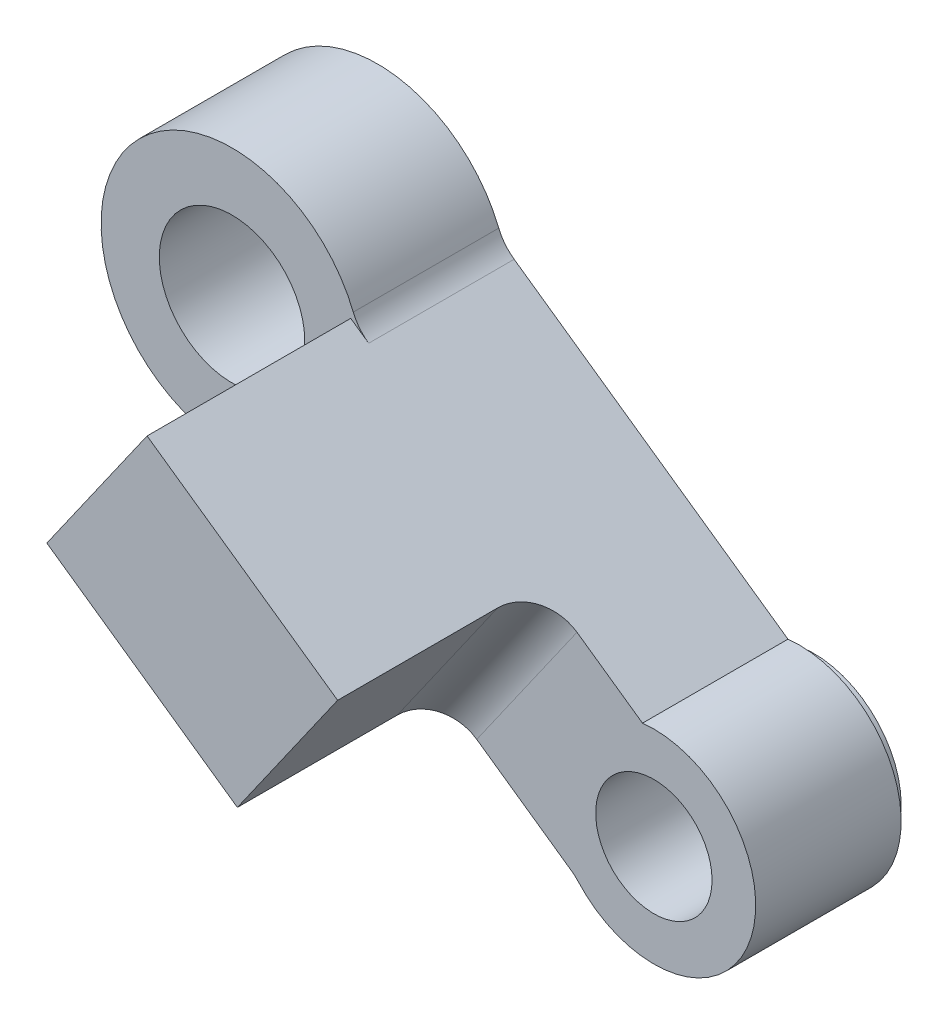
ISO-10303-21;
HEADER;
FILE_DESCRIPTION(('STEP AP214'),'2;1');
FILE_NAME('part.step','',(''),(''),'','','');
FILE_SCHEMA(('AUTOMOTIVE_DESIGN { 1 0 10303 214 1 1 1 1 }'));
ENDSEC;
DATA;
#1=APPLICATION_CONTEXT('core data for automotive mechanical design processes');
#2=APPLICATION_PROTOCOL_DEFINITION('international standard','automotive_design',2000,#1);
#3=PRODUCT_CONTEXT('',#1,'mechanical');
#4=PRODUCT('Part','Part','',(#3));
#5=PRODUCT_RELATED_PRODUCT_CATEGORY('part','',(#4));
#6=PRODUCT_DEFINITION_FORMATION('','',#4);
#7=PRODUCT_DEFINITION_CONTEXT('part definition',#1,'design');
#8=PRODUCT_DEFINITION('design','',#6,#7);
#9=PRODUCT_DEFINITION_SHAPE('','',#8);
#10=(LENGTH_UNIT() NAMED_UNIT(*) SI_UNIT(.MILLI.,.METRE.));
#11=(NAMED_UNIT(*) PLANE_ANGLE_UNIT() SI_UNIT($,.RADIAN.));
#12=(NAMED_UNIT(*) SI_UNIT($,.STERADIAN.) SOLID_ANGLE_UNIT());
#13=UNCERTAINTY_MEASURE_WITH_UNIT(LENGTH_MEASURE(1.E-05),#10,'distance_accuracy_value','');
#14=(GEOMETRIC_REPRESENTATION_CONTEXT(3) GLOBAL_UNCERTAINTY_ASSIGNED_CONTEXT((#13)) GLOBAL_UNIT_ASSIGNED_CONTEXT((#10,
#11,#12)) REPRESENTATION_CONTEXT('',''));
#15=CARTESIAN_POINT('',(0.,0.,0.));
#16=DIRECTION('',(0.,0.,1.));
#17=DIRECTION('',(1.,0.,0.));
#18=AXIS2_PLACEMENT_3D('',#15,#16,#17);
#19=CARTESIAN_POINT('',(14.5,-9.05,-5.));
#20=DIRECTION('',(0.,0.,-1.));
#21=DIRECTION('',(1.,0.,0.));
#22=AXIS2_PLACEMENT_3D('',#19,#20,#21);
#23=PLANE('',#22);
#24=CARTESIAN_POINT('',(0.,0.,-5.));
#25=DIRECTION('',(0.,0.,1.));
#26=DIRECTION('',(1.,0.,0.));
#27=AXIS2_PLACEMENT_3D('',#24,#25,#26);
#28=CIRCLE('',#27,2.5);
#29=CARTESIAN_POINT('',(2.5,0.,-5.));
#30=VERTEX_POINT('',#29);
#31=EDGE_CURVE('E167',#30,#30,#28,.T.);
#32=ORIENTED_EDGE('',*,*,#31,.T.);
#33=EDGE_LOOP('',(#32));
#34=FACE_BOUND('',#33,.T.);
#35=DIRECTION('',(-0.818662724250934,0.574274624132078,0.));
#36=VECTOR('',#35,1.);
#37=CARTESIAN_POINT('',(4.30670005617379,1.30473546213503,-5.));
#38=LINE('',#37,#36);
#39=CARTESIAN_POINT('',(14.1096606419003,-5.57183450860682,-5.));
#40=VERTEX_POINT('',#39);
#41=CARTESIAN_POINT('',(4.69715552562135,1.03083919042865,-5.));
#42=VERTEX_POINT('',#41);
#43=EDGE_CURVE('E175',#40,#42,#38,.T.);
#44=ORIENTED_EDGE('',*,*,#43,.F.);
#45=CARTESIAN_POINT('',(14.5,-9.05,-5.));
#46=DIRECTION('',(0.,0.,1.));
#47=DIRECTION('',(1.,0.,0.));
#48=AXIS2_PLACEMENT_3D('',#45,#46,#47);
#49=CIRCLE('',#48,3.5);
#50=CARTESIAN_POINT('',(11.9072437974673,-11.40108810431,-5.));
#51=VERTEX_POINT('',#50);
#52=EDGE_CURVE('E173',#51,#40,#49,.T.);
#53=ORIENTED_EDGE('',*,*,#52,.F.);
#54=CARTESIAN_POINT('',(10.7960625678104,-12.4086972918714,-5.));
#55=DIRECTION('',(0.,0.,1.));
#56=DIRECTION('',(1.,0.,0.));
#57=AXIS2_PLACEMENT_3D('',#54,#55,#56);
#58=CIRCLE('',#57,1.5);
#59=CARTESIAN_POINT('',(11.6574745040085,-11.180703205495,-5.));
#60=VERTEX_POINT('',#59);
#61=EDGE_CURVE('E11',#60,#51,#58,.F.);
#62=ORIENTED_EDGE('',*,*,#61,.F.);
#63=DIRECTION('',(0.818662724250933,-0.574274624132079,0.));
#64=VECTOR('',#63,1.);
#65=CARTESIAN_POINT('',(1.67358332842939,-4.17721424430244,-5.));
#66=LINE('',#65,#64);
#67=CARTESIAN_POINT('',(2.27925096573256,-4.60207730995562,-5.));
#68=VERTEX_POINT('',#67);
#69=EDGE_CURVE('E182',#68,#60,#66,.T.);
#70=ORIENTED_EDGE('',*,*,#69,.F.);
#71=CARTESIAN_POINT('',(1.41783902953444,-5.83007139633202,-5.));
#72=DIRECTION('',(0.,0.,1.));
#73=DIRECTION('',(1.,0.,0.));
#74=AXIS2_PLACEMENT_3D('',#71,#72,#73);
#75=CIRCLE('',#74,1.5);
#76=CARTESIAN_POINT('',(1.06337927215083,-4.37255354724902,-5.));
#77=VERTEX_POINT('',#76);
#78=EDGE_CURVE('E227',#77,#68,#75,.F.);
#79=ORIENTED_EDGE('',*,*,#78,.F.);
#80=CARTESIAN_POINT('',(0.,0.,-5.));
#81=DIRECTION('',(0.,0.,1.));
#82=DIRECTION('',(-1.,0.,0.));
#83=AXIS2_PLACEMENT_3D('',#80,#81,#82);
#84=CIRCLE('',#83,4.5);
#85=CARTESIAN_POINT('',(4.1689255963646,1.69412495760379,-5.));
#86=VERTEX_POINT('',#85);
#87=EDGE_CURVE('E179',#86,#77,#84,.T.);
#88=ORIENTED_EDGE('',*,*,#87,.F.);
#89=CARTESIAN_POINT('',(5.55856746181947,2.25883327680505,-5.));
#90=DIRECTION('',(0.,0.,1.));
#91=DIRECTION('',(1.,0.,0.));
#92=AXIS2_PLACEMENT_3D('',#89,#90,#91);
#93=CIRCLE('',#92,1.5);
#94=EDGE_CURVE('E209',#42,#86,#93,.F.);
#95=ORIENTED_EDGE('',*,*,#94,.F.);
#96=EDGE_LOOP('',(#44,#53,#62,#70,#79,#88,#95));
#97=FACE_BOUND('',#96,.T.);
#98=CARTESIAN_POINT('',(14.5,-9.05,-5.));
#99=DIRECTION('',(0.,0.,1.));
#100=DIRECTION('',(1.,0.,0.));
#101=AXIS2_PLACEMENT_3D('',#98,#99,#100);
#102=CIRCLE('',#101,3.00000000000009);
#103=CARTESIAN_POINT('',(17.5000000000001,-9.05,-5.));
#104=VERTEX_POINT('',#103);
#105=EDGE_CURVE('E257',#104,#104,#102,.T.);
#106=ORIENTED_EDGE('',*,*,#105,.T.);
#107=EDGE_LOOP('',(#106));
#108=FACE_BOUND('',#107,.T.);
#109=ADVANCED_FACE('F35',(#34,#97,#108),#23,.T.);
#110=CARTESIAN_POINT('',(14.5,-9.05,0.));
#111=DIRECTION('',(0.,0.,-1.));
#112=DIRECTION('',(1.,0.,0.));
#113=AXIS2_PLACEMENT_3D('',#110,#111,#112);
#114=PLANE('',#113);
#115=CARTESIAN_POINT('',(14.5,-9.05,0.));
#116=DIRECTION('',(0.,0.,1.));
#117=DIRECTION('',(1.,0.,0.));
#118=AXIS2_PLACEMENT_3D('',#115,#116,#117);
#119=CIRCLE('',#118,2.00000000000009);
#120=CARTESIAN_POINT('',(16.5000000000001,-9.05,0.));
#121=VERTEX_POINT('',#120);
#122=EDGE_CURVE('E163',#121,#121,#119,.T.);
#123=ORIENTED_EDGE('',*,*,#122,.F.);
#124=EDGE_LOOP('',(#123));
#125=FACE_BOUND('',#124,.T.);
#126=DIRECTION('',(0.818662724250933,-0.574274624132079,0.));
#127=VECTOR('',#126,1.);
#128=CARTESIAN_POINT('',(1.67358332842939,-4.17721424430244,0.));
#129=LINE('',#128,#127);
#130=CARTESIAN_POINT('',(8.41202205939429,-8.90408680711841,0.));
#131=VERTEX_POINT('',#130);
#132=CARTESIAN_POINT('',(11.6574745040085,-11.180703205495,0.));
#133=VERTEX_POINT('',#132);
#134=EDGE_CURVE('E176',#131,#133,#129,.T.);
#135=ORIENTED_EDGE('',*,*,#134,.T.);
#136=CARTESIAN_POINT('',(10.7960625678104,-12.4086972918714,0.));
#137=DIRECTION('',(0.,0.,1.));
#138=DIRECTION('',(1.,0.,0.));
#139=AXIS2_PLACEMENT_3D('',#136,#137,#138);
#140=CIRCLE('',#139,1.5);
#141=CARTESIAN_POINT('',(11.9072437974673,-11.40108810431,0.));
#142=VERTEX_POINT('',#141);
#143=EDGE_CURVE('E43',#142,#133,#140,.T.);
#144=ORIENTED_EDGE('',*,*,#143,.F.);
#145=CARTESIAN_POINT('',(14.5,-9.05,0.));
#146=DIRECTION('',(0.,0.,1.));
#147=DIRECTION('',(1.,0.,0.));
#148=AXIS2_PLACEMENT_3D('',#145,#146,#147);
#149=CIRCLE('',#148,3.5);
#150=CARTESIAN_POINT('',(14.1096606419003,-5.57183450860682,0.));
#151=VERTEX_POINT('',#150);
#152=EDGE_CURVE('E170',#142,#151,#149,.T.);
#153=ORIENTED_EDGE('',*,*,#152,.T.);
#154=DIRECTION('',(-0.818662724250934,0.574274624132078,0.));
#155=VECTOR('',#154,1.);
#156=CARTESIAN_POINT('',(4.30670005617379,1.30473546213503,0.));
#157=LINE('',#156,#155);
#158=CARTESIAN_POINT('',(11.8576698041868,-3.9921104616128,0.));
#159=VERTEX_POINT('',#158);
#160=EDGE_CURVE('E188',#151,#159,#157,.T.);
#161=ORIENTED_EDGE('',*,*,#160,.T.);
#162=DIRECTION('',(0.574274624132079,0.818662724250933,0.));
#163=VECTOR('',#162,1.);
#164=CARTESIAN_POINT('',(10.3511852621264,-6.13969401731833,0.));
#165=LINE('',#164,#163);
#166=EDGE_CURVE('E201',#131,#159,#165,.T.);
#167=ORIENTED_EDGE('',*,*,#166,.F.);
#168=EDGE_LOOP('',(#135,#144,#153,#161,#167));
#169=FACE_BOUND('',#168,.T.);
#170=ADVANCED_FACE('F233',(#125,#169),#114,.F.);
#171=CARTESIAN_POINT('',(0.,0.,0.));
#172=DIRECTION('',(0.,0.,1.));
#173=DIRECTION('',(-1.,0.,0.));
#174=AXIS2_PLACEMENT_3D('',#171,#172,#173);
#175=CIRCLE('',#174,4.5);
#176=CARTESIAN_POINT('',(4.1689255963646,1.69412495760379,0.));
#177=VERTEX_POINT('',#176);
#178=CARTESIAN_POINT('',(1.06337927215083,-4.37255354724902,0.));
#179=VERTEX_POINT('',#178);
#180=EDGE_CURVE('E191',#177,#179,#175,.T.);
#181=ORIENTED_EDGE('',*,*,#180,.T.);
#182=CARTESIAN_POINT('',(1.41783902953444,-5.83007139633202,0.));
#183=DIRECTION('',(0.,0.,1.));
#184=DIRECTION('',(1.,0.,0.));
#185=AXIS2_PLACEMENT_3D('',#182,#183,#184);
#186=CIRCLE('',#185,1.5);
#187=CARTESIAN_POINT('',(2.27925096573256,-4.60207730995562,0.));
#188=VERTEX_POINT('',#187);
#189=EDGE_CURVE('E224',#188,#179,#186,.T.);
#190=ORIENTED_EDGE('',*,*,#189,.F.);
#191=DIRECTION('',(0.818662724250933,-0.574274624132079,0.));
#192=VECTOR('',#191,1.);
#193=CARTESIAN_POINT('',(12.5608367972679,-11.8143927898001,0.));
#194=LINE('',#193,#192);
#195=CARTESIAN_POINT('',(0.634726179010426,-3.44847787786366,0.));
#196=VERTEX_POINT('',#195);
#197=EDGE_CURVE('E159',#196,#188,#194,.T.);
#198=ORIENTED_EDGE('',*,*,#197,.F.);
#199=DIRECTION('',(-0.574274624132079,-0.818662724250933,0.));
#200=VECTOR('',#199,1.);
#201=CARTESIAN_POINT('',(2.57388938174258,-0.684085088063578,0.));
#202=LINE('',#201,#200);
#203=CARTESIAN_POINT('',(2.04665681062733,-1.4356865603302,0.));
#204=VERTEX_POINT('',#203);
#205=EDGE_CURVE('E149',#204,#196,#202,.T.);
#206=ORIENTED_EDGE('',*,*,#205,.F.);
#207=CARTESIAN_POINT('',(0.,0.,0.));
#208=DIRECTION('',(0.,0.,1.));
#209=DIRECTION('',(1.,0.,0.));
#210=AXIS2_PLACEMENT_3D('',#207,#208,#209);
#211=CIRCLE('',#210,2.5);
#212=EDGE_CURVE('E166',#204,#204,#211,.T.);
#213=ORIENTED_EDGE('',*,*,#212,.F.);
#214=CARTESIAN_POINT('',(4.0803739238029,1.46349846764194,0.));
#215=VERTEX_POINT('',#214);
#216=EDGE_CURVE('E151',#215,#204,#202,.T.);
#217=ORIENTED_EDGE('',*,*,#216,.F.);
#218=DIRECTION('',(-0.818662724250934,0.574274624132078,0.));
#219=VECTOR('',#218,1.);
#220=CARTESIAN_POINT('',(16.0064845420603,-6.90241644429447,0.));
#221=LINE('',#220,#219);
#222=CARTESIAN_POINT('',(4.69715552562135,1.03083919042865,0.));
#223=VERTEX_POINT('',#222);
#224=EDGE_CURVE('E147',#223,#215,#221,.T.);
#225=ORIENTED_EDGE('',*,*,#224,.F.);
#226=CARTESIAN_POINT('',(5.55856746181947,2.25883327680505,0.));
#227=DIRECTION('',(0.,0.,1.));
#228=DIRECTION('',(1.,0.,0.));
#229=AXIS2_PLACEMENT_3D('',#226,#227,#228);
#230=CIRCLE('',#229,1.5);
#231=EDGE_CURVE('E206',#177,#223,#230,.T.);
#232=ORIENTED_EDGE('',*,*,#231,.F.);
#233=EDGE_LOOP('',(#181,#190,#198,#206,#213,#217,#225,#232));
#234=FACE_BOUND('',#233,.T.);
#235=ADVANCED_FACE('F286',(#234),#114,.F.);
#236=CARTESIAN_POINT('',(14.5,-9.05,-5.));
#237=DIRECTION('',(0.,0.,1.));
#238=DIRECTION('',(-1.,0.,0.));
#239=AXIS2_PLACEMENT_3D('',#236,#237,#238);
#240=CYLINDRICAL_SURFACE('',#239,3.5);
#241=ORIENTED_EDGE('',*,*,#52,.T.);
#242=DIRECTION('',(0.,0.,1.));
#243=VECTOR('',#242,1.);
#244=CARTESIAN_POINT('',(14.1096606419003,-5.57183450860682,-5.));
#245=LINE('',#244,#243);
#246=EDGE_CURVE('E185',#40,#151,#245,.T.);
#247=ORIENTED_EDGE('',*,*,#246,.T.);
#248=ORIENTED_EDGE('',*,*,#152,.F.);
#249=DIRECTION('',(0.,0.,1.));
#250=VECTOR('',#249,1.);
#251=CARTESIAN_POINT('',(11.9072437974673,-11.40108810431,-5.));
#252=LINE('',#251,#250);
#253=EDGE_CURVE('E50',#51,#142,#252,.T.);
#254=ORIENTED_EDGE('',*,*,#253,.F.);
#255=EDGE_LOOP('',(#241,#247,#248,#254));
#256=FACE_BOUND('',#255,.T.);
#257=ADVANCED_FACE('F246',(#256),#240,.T.);
#258=CARTESIAN_POINT('',(4.30670005617379,1.30473546213503,-5.));
#259=DIRECTION('',(-0.574274624132078,-0.818662724250934,0.));
#260=DIRECTION('',(0.818662724250934,-0.574274624132078,0.));
#261=AXIS2_PLACEMENT_3D('',#258,#259,#260);
#262=PLANE('',#261);
#263=ORIENTED_EDGE('',*,*,#224,.T.);
#264=DIRECTION('',(0.,0.,1.));
#265=VECTOR('',#264,1.);
#266=CARTESIAN_POINT('',(4.0803739238029,1.46349846764194,-18.7937068196315));
#267=LINE('',#266,#265);
#268=CARTESIAN_POINT('',(4.0803739238029,1.46349846764194,7.));
#269=VERTEX_POINT('',#268);
#270=EDGE_CURVE('E128',#215,#269,#267,.T.);
#271=ORIENTED_EDGE('',*,*,#270,.T.);
#272=DIRECTION('',(0.818662724250934,-0.574274624132078,0.));
#273=VECTOR('',#272,1.);
#274=CARTESIAN_POINT('',(4.0803739238029,1.46349846764194,7.));
#275=LINE('',#274,#273);
#276=CARTESIAN_POINT('',(10.6296757178104,-3.13069852541468,7.));
#277=VERTEX_POINT('',#276);
#278=EDGE_CURVE('E135',#269,#277,#275,.T.);
#279=ORIENTED_EDGE('',*,*,#278,.T.);
#280=DIRECTION('',(0.,0.,1.));
#281=VECTOR('',#280,1.);
#282=CARTESIAN_POINT('',(10.6296757178104,-3.13069852541468,-18.7937068196315));
#283=LINE('',#282,#281);
#284=CARTESIAN_POINT('',(10.6296757178104,-3.13069852541468,1.5));
#285=VERTEX_POINT('',#284);
#286=EDGE_CURVE('E156',#285,#277,#283,.T.);
#287=ORIENTED_EDGE('',*,*,#286,.F.);
#288=CARTESIAN_POINT('',(11.8576698041868,-3.9921104616128,1.5));
#289=DIRECTION('',(0.574274624132078,0.818662724250934,0.));
#290=DIRECTION('',(0.818662724250934,-0.574274624132078,0.));
#291=AXIS2_PLACEMENT_3D('',#288,#289,#290);
#292=CIRCLE('',#291,1.5);
#293=EDGE_CURVE('E212',#159,#285,#292,.T.);
#294=ORIENTED_EDGE('',*,*,#293,.F.);
#295=ORIENTED_EDGE('',*,*,#160,.F.);
#296=ORIENTED_EDGE('',*,*,#246,.F.);
#297=ORIENTED_EDGE('',*,*,#43,.T.);
#298=DIRECTION('',(0.,0.,-1.));
#299=VECTOR('',#298,1.);
#300=CARTESIAN_POINT('',(4.69715552562135,1.03083919042865,-5.));
#301=LINE('',#300,#299);
#302=EDGE_CURVE('E199',#223,#42,#301,.T.);
#303=ORIENTED_EDGE('',*,*,#302,.F.);
#304=EDGE_LOOP('',(#263,#271,#279,#287,#294,#295,#296,#297,#303));
#305=FACE_BOUND('',#304,.T.);
#306=ADVANCED_FACE('F145',(#305),#262,.F.);
#307=CARTESIAN_POINT('',(0.,0.,-5.));
#308=DIRECTION('',(0.,0.,1.));
#309=DIRECTION('',(-1.,0.,0.));
#310=AXIS2_PLACEMENT_3D('',#307,#308,#309);
#311=CYLINDRICAL_SURFACE('',#310,4.5);
#312=ORIENTED_EDGE('',*,*,#180,.F.);
#313=DIRECTION('',(0.,0.,1.));
#314=VECTOR('',#313,1.);
#315=CARTESIAN_POINT('',(4.1689255963646,1.69412495760379,-5.));
#316=LINE('',#315,#314);
#317=EDGE_CURVE('E197',#86,#177,#316,.T.);
#318=ORIENTED_EDGE('',*,*,#317,.F.);
#319=ORIENTED_EDGE('',*,*,#87,.T.);
#320=DIRECTION('',(0.,0.,1.));
#321=VECTOR('',#320,1.);
#322=CARTESIAN_POINT('',(1.06337927215083,-4.37255354724902,-5.));
#323=LINE('',#322,#321);
#324=EDGE_CURVE('E221',#179,#77,#323,.F.);
#325=ORIENTED_EDGE('',*,*,#324,.F.);
#326=EDGE_LOOP('',(#312,#318,#319,#325));
#327=FACE_BOUND('',#326,.T.);
#328=ADVANCED_FACE('F294',(#327),#311,.T.);
#329=CARTESIAN_POINT('',(1.67358332842939,-4.17721424430244,-5.));
#330=DIRECTION('',(0.574274624132079,0.818662724250933,0.));
#331=DIRECTION('',(-0.818662724250933,0.574274624132079,0.));
#332=AXIS2_PLACEMENT_3D('',#329,#330,#331);
#333=PLANE('',#332);
#334=ORIENTED_EDGE('',*,*,#69,.T.);
#335=DIRECTION('',(0.,0.,-1.));
#336=VECTOR('',#335,1.);
#337=CARTESIAN_POINT('',(11.6574745040085,-11.180703205495,-5.));
#338=LINE('',#337,#336);
#339=EDGE_CURVE('E217',#133,#60,#338,.T.);
#340=ORIENTED_EDGE('',*,*,#339,.F.);
#341=ORIENTED_EDGE('',*,*,#134,.F.);
#342=CARTESIAN_POINT('',(8.41202205939429,-8.9040868071184,1.5));
#343=DIRECTION('',(-0.574274624132079,-0.818662724250933,0.));
#344=DIRECTION('',(-0.818662724250933,0.574274624132079,0.));
#345=AXIS2_PLACEMENT_3D('',#342,#343,#344);
#346=CIRCLE('',#345,1.5);
#347=CARTESIAN_POINT('',(7.18402797301789,-8.04267487092029,1.5));
#348=VERTEX_POINT('',#347);
#349=EDGE_CURVE('E215',#348,#131,#346,.T.);
#350=ORIENTED_EDGE('',*,*,#349,.F.);
#351=DIRECTION('',(0.,0.,1.));
#352=VECTOR('',#351,1.);
#353=CARTESIAN_POINT('',(7.18402797301789,-8.04267487092029,-18.7937068196315));
#354=LINE('',#353,#352);
#355=CARTESIAN_POINT('',(7.18402797301789,-8.04267487092029,7.));
#356=VERTEX_POINT('',#355);
#357=EDGE_CURVE('E153',#348,#356,#354,.T.);
#358=ORIENTED_EDGE('',*,*,#357,.T.);
#359=DIRECTION('',(-0.818662724250933,0.574274624132079,0.));
#360=VECTOR('',#359,1.);
#361=CARTESIAN_POINT('',(0.634726179010426,-3.44847787786366,7.));
#362=LINE('',#361,#360);
#363=CARTESIAN_POINT('',(0.634726179010426,-3.44847787786366,7.));
#364=VERTEX_POINT('',#363);
#365=EDGE_CURVE('E253',#356,#364,#362,.T.);
#366=ORIENTED_EDGE('',*,*,#365,.T.);
#367=DIRECTION('',(0.,0.,1.));
#368=VECTOR('',#367,1.);
#369=CARTESIAN_POINT('',(0.634726179010426,-3.44847787786366,-18.7937068196315));
#370=LINE('',#369,#368);
#371=EDGE_CURVE('E131',#196,#364,#370,.T.);
#372=ORIENTED_EDGE('',*,*,#371,.F.);
#373=ORIENTED_EDGE('',*,*,#197,.T.);
#374=DIRECTION('',(0.,0.,-1.));
#375=VECTOR('',#374,1.);
#376=CARTESIAN_POINT('',(2.27925096573256,-4.60207730995562,0.));
#377=LINE('',#376,#375);
#378=EDGE_CURVE('E219',#68,#188,#377,.F.);
#379=ORIENTED_EDGE('',*,*,#378,.F.);
#380=EDGE_LOOP('',(#334,#340,#341,#350,#358,#366,#372,#373,#379));
#381=FACE_BOUND('',#380,.T.);
#382=ADVANCED_FACE('F236',(#381),#333,.F.);
#383=CARTESIAN_POINT('',(0.,0.,-5.));
#384=DIRECTION('',(0.,0.,1.));
#385=DIRECTION('',(-1.,0.,0.));
#386=AXIS2_PLACEMENT_3D('',#383,#384,#385);
#387=CYLINDRICAL_SURFACE('',#386,2.5);
#388=ORIENTED_EDGE('',*,*,#212,.T.);
#389=EDGE_LOOP('',(#388));
#390=FACE_BOUND('',#389,.T.);
#391=ORIENTED_EDGE('',*,*,#31,.F.);
#392=EDGE_LOOP('',(#391));
#393=FACE_BOUND('',#392,.T.);
#394=ADVANCED_FACE('F270',(#390,#393),#387,.F.);
#395=CARTESIAN_POINT('',(14.5,-9.05,-5.));
#396=DIRECTION('',(0.,0.,1.));
#397=DIRECTION('',(-1.,0.,0.));
#398=AXIS2_PLACEMENT_3D('',#395,#396,#397);
#399=CYLINDRICAL_SURFACE('',#398,2.00000000000009);
#400=ORIENTED_EDGE('',*,*,#122,.T.);
#401=EDGE_LOOP('',(#400));
#402=FACE_BOUND('',#401,.T.);
#403=CARTESIAN_POINT('',(14.5,-9.05,-5.5));
#404=DIRECTION('',(0.,0.,1.));
#405=DIRECTION('',(1.,0.,0.));
#406=AXIS2_PLACEMENT_3D('',#403,#404,#405);
#407=CIRCLE('',#406,2.00000000000009);
#408=CARTESIAN_POINT('',(16.5000000000001,-9.05,-5.5));
#409=VERTEX_POINT('',#408);
#410=EDGE_CURVE('E260',#409,#409,#407,.T.);
#411=ORIENTED_EDGE('',*,*,#410,.F.);
#412=EDGE_LOOP('',(#411));
#413=FACE_BOUND('',#412,.T.);
#414=ADVANCED_FACE('F268',(#402,#413),#399,.F.);
#415=CARTESIAN_POINT('',(7.18402797301789,-8.04267487092029,-18.7937068196315));
#416=DIRECTION('',(0.818662724250933,-0.574274624132079,0.));
#417=DIRECTION('',(0.574274624132079,0.818662724250933,0.));
#418=AXIS2_PLACEMENT_3D('',#415,#416,#417);
#419=PLANE('',#418);
#420=ORIENTED_EDGE('',*,*,#286,.T.);
#421=DIRECTION('',(-0.574274624132079,-0.818662724250933,0.));
#422=VECTOR('',#421,1.);
#423=CARTESIAN_POINT('',(7.18402797301789,-8.04267487092029,7.));
#424=LINE('',#423,#422);
#425=EDGE_CURVE('E140',#277,#356,#424,.T.);
#426=ORIENTED_EDGE('',*,*,#425,.T.);
#427=ORIENTED_EDGE('',*,*,#357,.F.);
#428=DIRECTION('',(0.574274624132079,0.818662724250933,0.));
#429=VECTOR('',#428,1.);
#430=CARTESIAN_POINT('',(7.18402797301789,-8.04267487092029,1.5));
#431=LINE('',#430,#429);
#432=EDGE_CURVE('E204',#285,#348,#431,.F.);
#433=ORIENTED_EDGE('',*,*,#432,.F.);
#434=EDGE_LOOP('',(#420,#426,#427,#433));
#435=FACE_BOUND('',#434,.T.);
#436=ADVANCED_FACE('F252',(#435),#419,.T.);
#437=CARTESIAN_POINT('',(0.634726179010426,-3.44847787786366,-18.7937068196315));
#438=DIRECTION('',(-0.818662724250933,0.574274624132079,0.));
#439=DIRECTION('',(-0.574274624132079,-0.818662724250933,0.));
#440=AXIS2_PLACEMENT_3D('',#437,#438,#439);
#441=PLANE('',#440);
#442=ORIENTED_EDGE('',*,*,#216,.T.);
#443=ORIENTED_EDGE('',*,*,#205,.T.);
#444=ORIENTED_EDGE('',*,*,#371,.T.);
#445=DIRECTION('',(0.574274624132079,0.818662724250933,0.));
#446=VECTOR('',#445,1.);
#447=CARTESIAN_POINT('',(0.634726179010426,-3.44847787786366,7.));
#448=LINE('',#447,#446);
#449=EDGE_CURVE('E124',#364,#269,#448,.T.);
#450=ORIENTED_EDGE('',*,*,#449,.T.);
#451=ORIENTED_EDGE('',*,*,#270,.F.);
#452=EDGE_LOOP('',(#442,#443,#444,#450,#451));
#453=FACE_BOUND('',#452,.T.);
#454=ADVANCED_FACE('F126',(#453),#441,.T.);
#455=CARTESIAN_POINT('',(0.,0.,7.));
#456=DIRECTION('',(0.,0.,1.));
#457=DIRECTION('',(-1.,0.,0.));
#458=AXIS2_PLACEMENT_3D('',#455,#456,#457);
#459=PLANE('',#458);
#460=ORIENTED_EDGE('',*,*,#449,.F.);
#461=ORIENTED_EDGE('',*,*,#365,.F.);
#462=ORIENTED_EDGE('',*,*,#425,.F.);
#463=ORIENTED_EDGE('',*,*,#278,.F.);
#464=EDGE_LOOP('',(#460,#461,#462,#463));
#465=FACE_BOUND('',#464,.T.);
#466=ADVANCED_FACE('F139',(#465),#459,.T.);
#467=CARTESIAN_POINT('',(5.55856746181947,2.25883327680505,-5.));
#468=DIRECTION('',(0.,0.,1.));
#469=DIRECTION('',(-1.,0.,0.));
#470=AXIS2_PLACEMENT_3D('',#467,#468,#469);
#471=CYLINDRICAL_SURFACE('',#470,1.5);
#472=ORIENTED_EDGE('',*,*,#94,.T.);
#473=ORIENTED_EDGE('',*,*,#317,.T.);
#474=ORIENTED_EDGE('',*,*,#231,.T.);
#475=ORIENTED_EDGE('',*,*,#302,.T.);
#476=EDGE_LOOP('',(#472,#473,#474,#475));
#477=FACE_BOUND('',#476,.T.);
#478=ADVANCED_FACE('F302',(#477),#471,.F.);
#479=CARTESIAN_POINT('',(10.3511852621264,-6.13969401731833,1.5));
#480=DIRECTION('',(0.574274624132079,0.818662724250933,0.));
#481=DIRECTION('',(-0.818662724250933,0.574274624132079,0.));
#482=AXIS2_PLACEMENT_3D('',#479,#480,#481);
#483=CYLINDRICAL_SURFACE('',#482,1.5);
#484=ORIENTED_EDGE('',*,*,#349,.T.);
#485=ORIENTED_EDGE('',*,*,#166,.T.);
#486=ORIENTED_EDGE('',*,*,#293,.T.);
#487=ORIENTED_EDGE('',*,*,#432,.T.);
#488=EDGE_LOOP('',(#484,#485,#486,#487));
#489=FACE_BOUND('',#488,.T.);
#490=ADVANCED_FACE('F249',(#489),#483,.F.);
#491=CARTESIAN_POINT('',(1.41783902953444,-5.83007139633202,-5.));
#492=DIRECTION('',(0.,0.,1.));
#493=DIRECTION('',(-1.,0.,0.));
#494=AXIS2_PLACEMENT_3D('',#491,#492,#493);
#495=CYLINDRICAL_SURFACE('',#494,1.5);
#496=ORIENTED_EDGE('',*,*,#78,.T.);
#497=ORIENTED_EDGE('',*,*,#378,.T.);
#498=ORIENTED_EDGE('',*,*,#189,.T.);
#499=ORIENTED_EDGE('',*,*,#324,.T.);
#500=EDGE_LOOP('',(#496,#497,#498,#499));
#501=FACE_BOUND('',#500,.T.);
#502=ADVANCED_FACE('F307',(#501),#495,.F.);
#503=CARTESIAN_POINT('',(10.7960625678104,-12.4086972918714,-5.));
#504=DIRECTION('',(0.,0.,1.));
#505=DIRECTION('',(-1.,0.,0.));
#506=AXIS2_PLACEMENT_3D('',#503,#504,#505);
#507=CYLINDRICAL_SURFACE('',#506,1.5);
#508=ORIENTED_EDGE('',*,*,#61,.T.);
#509=ORIENTED_EDGE('',*,*,#253,.T.);
#510=ORIENTED_EDGE('',*,*,#143,.T.);
#511=ORIENTED_EDGE('',*,*,#339,.T.);
#512=EDGE_LOOP('',(#508,#509,#510,#511));
#513=FACE_BOUND('',#512,.T.);
#514=ADVANCED_FACE('F37',(#513),#507,.F.);
#515=CARTESIAN_POINT('',(14.5,-9.05,-5.5));
#516=DIRECTION('',(0.,0.,-1.));
#517=DIRECTION('',(1.,0.,0.));
#518=AXIS2_PLACEMENT_3D('',#515,#516,#517);
#519=PLANE('',#518);
#520=CARTESIAN_POINT('',(14.5,-9.05,-5.5));
#521=DIRECTION('',(0.,0.,1.));
#522=DIRECTION('',(1.,0.,0.));
#523=AXIS2_PLACEMENT_3D('',#520,#521,#522);
#524=CIRCLE('',#523,3.00000000000009);
#525=CARTESIAN_POINT('',(17.5000000000001,-9.05,-5.5));
#526=VERTEX_POINT('',#525);
#527=EDGE_CURVE('E136',#526,#526,#524,.T.);
#528=ORIENTED_EDGE('',*,*,#527,.F.);
#529=EDGE_LOOP('',(#528));
#530=FACE_BOUND('',#529,.T.);
#531=ORIENTED_EDGE('',*,*,#410,.T.);
#532=EDGE_LOOP('',(#531));
#533=FACE_BOUND('',#532,.T.);
#534=ADVANCED_FACE('F266',(#530,#533),#519,.T.);
#535=CARTESIAN_POINT('',(14.5,-9.05,-5.5));
#536=DIRECTION('',(0.,0.,1.));
#537=DIRECTION('',(-1.,0.,0.));
#538=AXIS2_PLACEMENT_3D('',#535,#536,#537);
#539=CYLINDRICAL_SURFACE('',#538,3.00000000000009);
#540=ORIENTED_EDGE('',*,*,#527,.T.);
#541=EDGE_LOOP('',(#540));
#542=FACE_BOUND('',#541,.T.);
#543=ORIENTED_EDGE('',*,*,#105,.F.);
#544=EDGE_LOOP('',(#543));
#545=FACE_BOUND('',#544,.T.);
#546=ADVANCED_FACE('F325',(#542,#545),#539,.T.);
#547=CLOSED_SHELL('',(#109,#170,#235,#257,#306,#328,#382,#394,#414,#436,#454,#466,#478,#490,
#502,#514,#534,#546));
#548=MANIFOLD_SOLID_BREP('B2',#547);
#549=ADVANCED_BREP_SHAPE_REPRESENTATION('',(#18,#548),#14);
#550=SHAPE_DEFINITION_REPRESENTATION(#9,#549);
ENDSEC;
END-ISO-10303-21;
